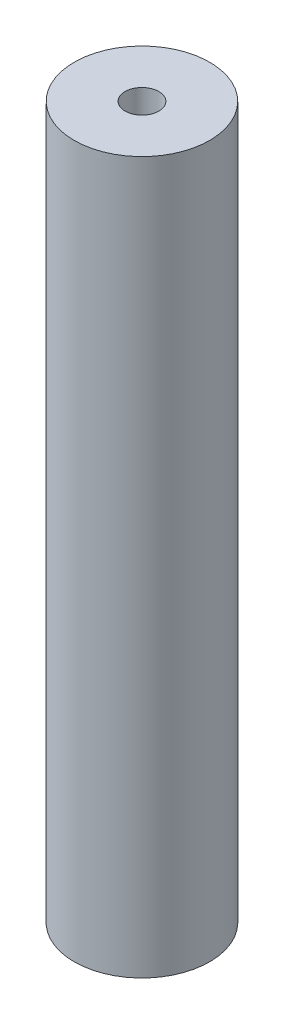
ISO-10303-21;
HEADER;
FILE_DESCRIPTION(('STEP AP214'),'2;1');
FILE_NAME('part.step','',(''),(''),'','','');
FILE_SCHEMA(('AUTOMOTIVE_DESIGN { 1 0 10303 214 1 1 1 1 }'));
ENDSEC;
DATA;
#1=APPLICATION_CONTEXT('core data for automotive mechanical design processes');
#2=APPLICATION_PROTOCOL_DEFINITION('international standard','automotive_design',2000,#1);
#3=PRODUCT_CONTEXT('',#1,'mechanical');
#4=PRODUCT('Part','Part','',(#3));
#5=PRODUCT_RELATED_PRODUCT_CATEGORY('part','',(#4));
#6=PRODUCT_DEFINITION_FORMATION('','',#4);
#7=PRODUCT_DEFINITION_CONTEXT('part definition',#1,'design');
#8=PRODUCT_DEFINITION('design','',#6,#7);
#9=PRODUCT_DEFINITION_SHAPE('','',#8);
#10=(LENGTH_UNIT() NAMED_UNIT(*) SI_UNIT(.MILLI.,.METRE.));
#11=(NAMED_UNIT(*) PLANE_ANGLE_UNIT() SI_UNIT($,.RADIAN.));
#12=(NAMED_UNIT(*) SI_UNIT($,.STERADIAN.) SOLID_ANGLE_UNIT());
#13=UNCERTAINTY_MEASURE_WITH_UNIT(LENGTH_MEASURE(1.E-05),#10,'distance_accuracy_value','');
#14=(GEOMETRIC_REPRESENTATION_CONTEXT(3) GLOBAL_UNCERTAINTY_ASSIGNED_CONTEXT((#13)) GLOBAL_UNIT_ASSIGNED_CONTEXT((#10,
#11,#12)) REPRESENTATION_CONTEXT('',''));
#15=CARTESIAN_POINT('',(0.,0.,0.));
#16=DIRECTION('',(0.,0.,1.));
#17=DIRECTION('',(1.,0.,0.));
#18=AXIS2_PLACEMENT_3D('',#15,#16,#17);
#19=CARTESIAN_POINT('',(0.,105.,0.));
#20=DIRECTION('',(0.,-1.,0.));
#21=DIRECTION('',(0.,0.,-1.));
#22=AXIS2_PLACEMENT_3D('',#19,#20,#21);
#23=CYLINDRICAL_SURFACE('',#22,10.);
#24=CARTESIAN_POINT('',(0.,105.,0.));
#25=DIRECTION('',(0.,1.,0.));
#26=DIRECTION('',(0.,0.,1.));
#27=AXIS2_PLACEMENT_3D('',#24,#25,#26);
#28=CIRCLE('',#27,10.);
#29=CARTESIAN_POINT('',(0.,105.,10.));
#30=VERTEX_POINT('',#29);
#31=EDGE_CURVE('E10',#30,#30,#28,.T.);
#32=ORIENTED_EDGE('',*,*,#31,.F.);
#33=EDGE_LOOP('',(#32));
#34=FACE_BOUND('',#33,.T.);
#35=CARTESIAN_POINT('',(0.,0.,0.));
#36=DIRECTION('',(0.,1.,0.));
#37=DIRECTION('',(0.,0.,1.));
#38=AXIS2_PLACEMENT_3D('',#35,#36,#37);
#39=CIRCLE('',#38,10.);
#40=CARTESIAN_POINT('',(0.,0.,10.));
#41=VERTEX_POINT('',#40);
#42=EDGE_CURVE('E38',#41,#41,#39,.T.);
#43=ORIENTED_EDGE('',*,*,#42,.T.);
#44=EDGE_LOOP('',(#43));
#45=FACE_BOUND('',#44,.T.);
#46=ADVANCED_FACE('F35',(#34,#45),#23,.T.);
#47=CARTESIAN_POINT('',(0.,105.,0.));
#48=DIRECTION('',(0.,1.,0.));
#49=DIRECTION('',(0.,0.,1.));
#50=AXIS2_PLACEMENT_3D('',#47,#48,#49);
#51=PLANE('',#50);
#52=CARTESIAN_POINT('',(0.,105.,0.));
#53=DIRECTION('',(0.,1.,0.));
#54=DIRECTION('',(0.,0.,1.));
#55=AXIS2_PLACEMENT_3D('',#52,#53,#54);
#56=CIRCLE('',#55,2.5);
#57=CARTESIAN_POINT('',(0.,105.,2.5));
#58=VERTEX_POINT('',#57);
#59=EDGE_CURVE('E47',#58,#58,#56,.T.);
#60=ORIENTED_EDGE('',*,*,#59,.F.);
#61=EDGE_LOOP('',(#60));
#62=FACE_BOUND('',#61,.T.);
#63=ORIENTED_EDGE('',*,*,#31,.T.);
#64=EDGE_LOOP('',(#63));
#65=FACE_BOUND('',#64,.T.);
#66=ADVANCED_FACE('F72',(#62,#65),#51,.T.);
#67=CARTESIAN_POINT('',(0.,0.,0.));
#68=DIRECTION('',(0.,1.,0.));
#69=DIRECTION('',(0.,0.,1.));
#70=AXIS2_PLACEMENT_3D('',#67,#68,#69);
#71=PLANE('',#70);
#72=CARTESIAN_POINT('',(0.,0.,0.));
#73=DIRECTION('',(0.,-1.,0.));
#74=DIRECTION('',(0.,0.,-1.));
#75=AXIS2_PLACEMENT_3D('',#72,#73,#74);
#76=CIRCLE('',#75,2.5);
#77=CARTESIAN_POINT('',(0.,0.,-2.5));
#78=VERTEX_POINT('',#77);
#79=EDGE_CURVE('E53',#78,#78,#76,.T.);
#80=ORIENTED_EDGE('',*,*,#79,.F.);
#81=EDGE_LOOP('',(#80));
#82=FACE_BOUND('',#81,.T.);
#83=ORIENTED_EDGE('',*,*,#42,.F.);
#84=EDGE_LOOP('',(#83));
#85=FACE_BOUND('',#84,.T.);
#86=ADVANCED_FACE('F68',(#82,#85),#71,.F.);
#87=CARTESIAN_POINT('',(0.,97.,0.));
#88=DIRECTION('',(0.,1.,0.));
#89=DIRECTION('',(0.,0.,1.));
#90=AXIS2_PLACEMENT_3D('',#87,#88,#89);
#91=CYLINDRICAL_SURFACE('',#90,2.5);
#92=CARTESIAN_POINT('',(0.,97.,0.));
#93=DIRECTION('',(0.,1.,0.));
#94=DIRECTION('',(0.,0.,1.));
#95=AXIS2_PLACEMENT_3D('',#92,#93,#94);
#96=CIRCLE('',#95,2.5);
#97=CARTESIAN_POINT('',(0.,97.,2.5));
#98=VERTEX_POINT('',#97);
#99=EDGE_CURVE('E45',#98,#98,#96,.T.);
#100=ORIENTED_EDGE('',*,*,#99,.F.);
#101=EDGE_LOOP('',(#100));
#102=FACE_BOUND('',#101,.T.);
#103=ORIENTED_EDGE('',*,*,#59,.T.);
#104=EDGE_LOOP('',(#103));
#105=FACE_BOUND('',#104,.T.);
#106=ADVANCED_FACE('F71',(#102,#105),#91,.F.);
#107=CARTESIAN_POINT('',(0.,97.,0.));
#108=DIRECTION('',(0.,1.,0.));
#109=DIRECTION('',(0.,0.,1.));
#110=AXIS2_PLACEMENT_3D('',#107,#108,#109);
#111=PLANE('',#110);
#112=ORIENTED_EDGE('',*,*,#99,.T.);
#113=EDGE_LOOP('',(#112));
#114=FACE_BOUND('',#113,.T.);
#115=ADVANCED_FACE('F64',(#114),#111,.T.);
#116=CARTESIAN_POINT('',(0.,8.,0.));
#117=DIRECTION('',(0.,-1.,0.));
#118=DIRECTION('',(0.,0.,-1.));
#119=AXIS2_PLACEMENT_3D('',#116,#117,#118);
#120=CYLINDRICAL_SURFACE('',#119,2.5);
#121=CARTESIAN_POINT('',(0.,8.,0.));
#122=DIRECTION('',(0.,-1.,0.));
#123=DIRECTION('',(0.,0.,-1.));
#124=AXIS2_PLACEMENT_3D('',#121,#122,#123);
#125=CIRCLE('',#124,2.5);
#126=CARTESIAN_POINT('',(0.,8.,-2.5));
#127=VERTEX_POINT('',#126);
#128=EDGE_CURVE('E50',#127,#127,#125,.T.);
#129=ORIENTED_EDGE('',*,*,#128,.F.);
#130=EDGE_LOOP('',(#129));
#131=FACE_BOUND('',#130,.T.);
#132=ORIENTED_EDGE('',*,*,#79,.T.);
#133=EDGE_LOOP('',(#132));
#134=FACE_BOUND('',#133,.T.);
#135=ADVANCED_FACE('F61',(#131,#134),#120,.F.);
#136=CARTESIAN_POINT('',(0.,8.,0.));
#137=DIRECTION('',(0.,-1.,0.));
#138=DIRECTION('',(0.,0.,-1.));
#139=AXIS2_PLACEMENT_3D('',#136,#137,#138);
#140=PLANE('',#139);
#141=ORIENTED_EDGE('',*,*,#128,.T.);
#142=EDGE_LOOP('',(#141));
#143=FACE_BOUND('',#142,.T.);
#144=ADVANCED_FACE('F59',(#143),#140,.T.);
#145=CLOSED_SHELL('',(#46,#66,#86,#106,#115,#135,#144));
#146=MANIFOLD_SOLID_BREP('B2',#145);
#147=ADVANCED_BREP_SHAPE_REPRESENTATION('',(#18,#146),#14);
#148=SHAPE_DEFINITION_REPRESENTATION(#9,#147);
ENDSEC;
END-ISO-10303-21;
